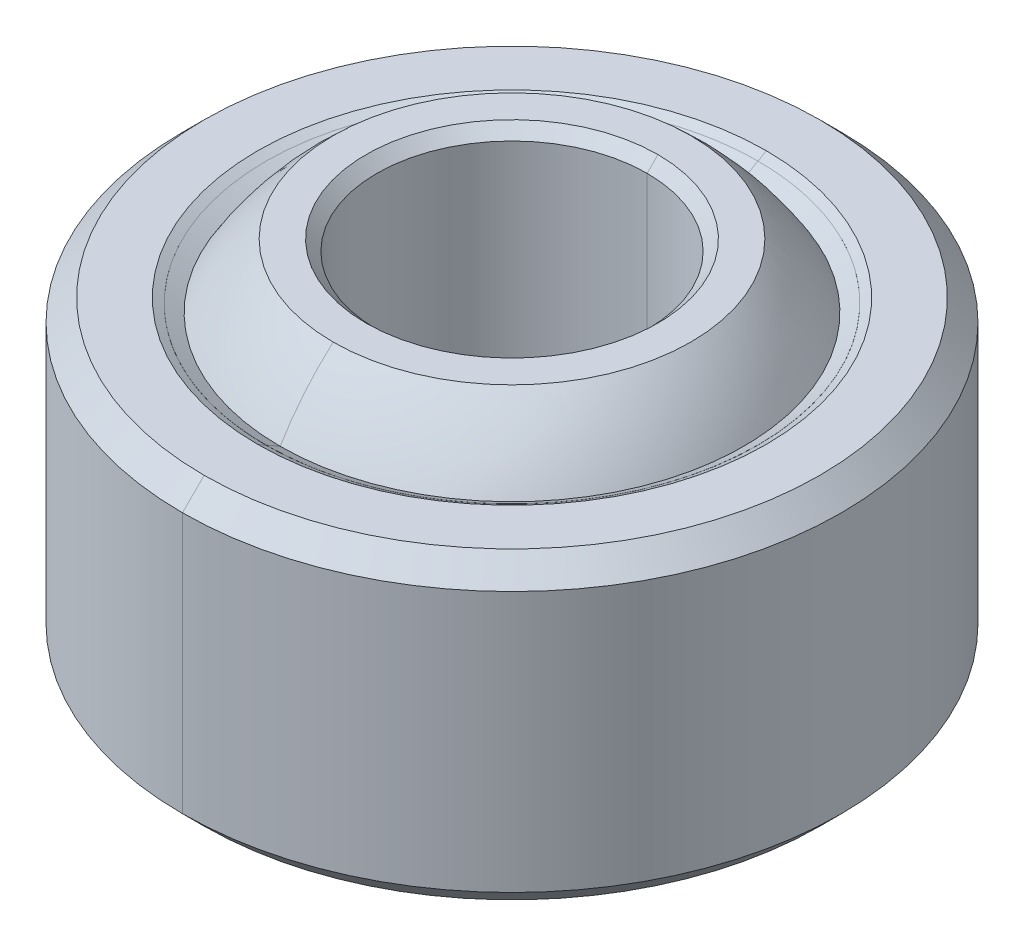
ISO-10303-21;
HEADER;
FILE_DESCRIPTION(('STEP AP214'),'2;1');
FILE_NAME('part.step','',(''),(''),'','','');
FILE_SCHEMA(('AUTOMOTIVE_DESIGN { 1 0 10303 214 1 1 1 1 }'));
ENDSEC;
DATA;
#1=APPLICATION_CONTEXT('core data for automotive mechanical design processes');
#2=APPLICATION_PROTOCOL_DEFINITION('international standard','automotive_design',2000,#1);
#3=PRODUCT_CONTEXT('',#1,'mechanical');
#4=PRODUCT('Part','Part','',(#3));
#5=PRODUCT_RELATED_PRODUCT_CATEGORY('part','',(#4));
#6=PRODUCT_DEFINITION_FORMATION('','',#4);
#7=PRODUCT_DEFINITION_CONTEXT('part definition',#1,'design');
#8=PRODUCT_DEFINITION('design','',#6,#7);
#9=PRODUCT_DEFINITION_SHAPE('','',#8);
#10=(LENGTH_UNIT() NAMED_UNIT(*) SI_UNIT(.MILLI.,.METRE.));
#11=(NAMED_UNIT(*) PLANE_ANGLE_UNIT() SI_UNIT($,.RADIAN.));
#12=(NAMED_UNIT(*) SI_UNIT($,.STERADIAN.) SOLID_ANGLE_UNIT());
#13=UNCERTAINTY_MEASURE_WITH_UNIT(LENGTH_MEASURE(1.E-05),#10,'distance_accuracy_value','');
#14=(GEOMETRIC_REPRESENTATION_CONTEXT(3) GLOBAL_UNCERTAINTY_ASSIGNED_CONTEXT((#13)) GLOBAL_UNIT_ASSIGNED_CONTEXT((#10,
#11,#12)) REPRESENTATION_CONTEXT('',''));
#15=CARTESIAN_POINT('',(0.,0.,0.));
#16=DIRECTION('',(0.,0.,1.));
#17=DIRECTION('',(1.,0.,0.));
#18=AXIS2_PLACEMENT_3D('',#15,#16,#17);
#19=CARTESIAN_POINT('',(0.,3.5687,-6.60254622031259));
#20=DIRECTION('',(0.,1.,0.));
#21=DIRECTION('',(1.,0.,0.));
#22=AXIS2_PLACEMENT_3D('',#19,#20,#21);
#23=PLANE('',#22);
#24=CARTESIAN_POINT('',(0.,3.5687,0.));
#25=DIRECTION('',(0.,-1.,0.));
#26=DIRECTION('',(0.,0.,-1.));
#27=AXIS2_PLACEMENT_3D('',#24,#25,#26);
#28=CIRCLE('',#27,7.23138);
#29=CARTESIAN_POINT('',(0.,3.5687,-7.23138));
#30=VERTEX_POINT('',#29);
#31=CARTESIAN_POINT('',(0.,3.5687,7.23138));
#32=VERTEX_POINT('',#31);
#33=EDGE_CURVE('P0_E43',#30,#32,#28,.T.);
#34=ORIENTED_EDGE('',*,*,#33,.F.);
#35=CARTESIAN_POINT('',(0.,3.5687,0.));
#36=DIRECTION('',(0.,-1.,0.));
#37=DIRECTION('',(0.,0.,-1.));
#38=AXIS2_PLACEMENT_3D('',#35,#36,#37);
#39=CIRCLE('',#38,7.23138);
#40=EDGE_CURVE('P0_E251',#32,#30,#39,.T.);
#41=ORIENTED_EDGE('',*,*,#40,.F.);
#42=EDGE_LOOP('',(#34,#41));
#43=FACE_BOUND('',#42,.T.);
#44=CARTESIAN_POINT('',(0.,3.5687,0.));
#45=DIRECTION('',(0.,-1.,0.));
#46=DIRECTION('',(0.,0.,-1.));
#47=AXIS2_PLACEMENT_3D('',#44,#45,#46);
#48=CIRCLE('',#47,5.97371244062518);
#49=CARTESIAN_POINT('',(0.,3.5687,-5.97371244062518));
#50=VERTEX_POINT('',#49);
#51=CARTESIAN_POINT('',(0.,3.5687,5.97371244062518));
#52=VERTEX_POINT('',#51);
#53=EDGE_CURVE('P0_E11',#50,#52,#48,.T.);
#54=ORIENTED_EDGE('',*,*,#53,.T.);
#55=CARTESIAN_POINT('',(0.,3.5687,0.));
#56=DIRECTION('',(0.,-1.,0.));
#57=DIRECTION('',(0.,0.,-1.));
#58=AXIS2_PLACEMENT_3D('',#55,#56,#57);
#59=CIRCLE('',#58,5.97371244062518);
#60=EDGE_CURVE('P0_E29',#52,#50,#59,.T.);
#61=ORIENTED_EDGE('',*,*,#60,.T.);
#62=EDGE_LOOP('',(#54,#61));
#63=FACE_BOUND('',#62,.T.);
#64=ADVANCED_FACE('P0_F16',(#43,#63),#23,.T.);
#65=CARTESIAN_POINT('',(0.,3.416554,0.));
#66=DIRECTION('',(0.,1.,0.));
#67=DIRECTION('',(0.,0.,-1.));
#68=AXIS2_PLACEMENT_3D('',#65,#66,#67);
#69=CONICAL_SURFACE('',#68,5.71018783845681,1.0471975511966);
#70=DIRECTION('',(0.,-0.5,0.866025403784439));
#71=VECTOR('',#70,1.);
#72=CARTESIAN_POINT('',(0.,3.416554,-5.71018783845681));
#73=LINE('',#72,#71);
#74=CARTESIAN_POINT('',(0.,3.45493198231586,-5.77666045371986));
#75=VERTEX_POINT('',#74);
#76=EDGE_CURVE('P0_E223',#50,#75,#73,.T.);
#77=ORIENTED_EDGE('',*,*,#76,.T.);
#78=CARTESIAN_POINT('',(0.,3.45493198231586,0.));
#79=DIRECTION('',(0.,1.,0.));
#80=DIRECTION('',(0.,0.,-1.));
#81=AXIS2_PLACEMENT_3D('',#78,#79,#80);
#82=CIRCLE('',#81,5.77666045371986);
#83=CARTESIAN_POINT('',(0.,3.45493198231587,5.77666045371987));
#84=VERTEX_POINT('',#83);
#85=EDGE_CURVE('P0_E283',#84,#75,#82,.T.);
#86=ORIENTED_EDGE('',*,*,#85,.F.);
#87=DIRECTION('',(0.,0.5,0.866025403784439));
#88=VECTOR('',#87,1.);
#89=CARTESIAN_POINT('',(0.,3.416554,5.71018783845681));
#90=LINE('',#89,#88);
#91=EDGE_CURVE('P0_E227',#84,#52,#90,.T.);
#92=ORIENTED_EDGE('',*,*,#91,.T.);
#93=ORIENTED_EDGE('',*,*,#53,.F.);
#94=EDGE_LOOP('',(#77,#86,#92,#93));
#95=FACE_BOUND('',#94,.T.);
#96=ADVANCED_FACE('P0_F308',(#95),#69,.F.);
#97=CARTESIAN_POINT('',(0.,3.416554,0.));
#98=DIRECTION('',(0.,1.,0.));
#99=DIRECTION('',(0.,0.,-1.));
#100=AXIS2_PLACEMENT_3D('',#97,#98,#99);
#101=CONICAL_SURFACE('',#100,5.71018783845681,1.0471975511966);
#102=ORIENTED_EDGE('',*,*,#76,.F.);
#103=ORIENTED_EDGE('',*,*,#60,.F.);
#104=ORIENTED_EDGE('',*,*,#91,.F.);
#105=CARTESIAN_POINT('',(0.,3.45493198231586,0.));
#106=DIRECTION('',(0.,1.,0.));
#107=DIRECTION('',(0.,0.,-1.));
#108=AXIS2_PLACEMENT_3D('',#105,#106,#107);
#109=CIRCLE('',#108,5.77666045371986);
#110=EDGE_CURVE('P0_E235',#75,#84,#109,.T.);
#111=ORIENTED_EDGE('',*,*,#110,.F.);
#112=EDGE_LOOP('',(#102,#103,#104,#111));
#113=FACE_BOUND('',#112,.T.);
#114=ADVANCED_FACE('P0_F392',(#113),#101,.F.);
#115=CARTESIAN_POINT('',(0.,3.3147,0.));
#116=DIRECTION('',(0.,-1.,0.));
#117=DIRECTION('',(0.,0.,-1.));
#118=AXIS2_PLACEMENT_3D('',#115,#116,#117);
#119=CONICAL_SURFACE('',#118,7.48538,0.785398163397449);
#120=DIRECTION('',(0.,-0.707106781186547,-0.707106781186548));
#121=VECTOR('',#120,1.);
#122=CARTESIAN_POINT('',(0.,3.3147,-7.48538));
#123=LINE('',#122,#121);
#124=CARTESIAN_POINT('',(0.,3.0607,-7.73938));
#125=VERTEX_POINT('',#124);
#126=EDGE_CURVE('P0_E250',#30,#125,#123,.T.);
#127=ORIENTED_EDGE('',*,*,#126,.T.);
#128=CARTESIAN_POINT('',(0.,3.0607,0.));
#129=DIRECTION('',(0.,-1.,0.));
#130=DIRECTION('',(0.,0.,-1.));
#131=AXIS2_PLACEMENT_3D('',#128,#129,#130);
#132=CIRCLE('',#131,7.73938);
#133=CARTESIAN_POINT('',(0.,3.0607,7.73938));
#134=VERTEX_POINT('',#133);
#135=EDGE_CURVE('P0_E245',#134,#125,#132,.T.);
#136=ORIENTED_EDGE('',*,*,#135,.F.);
#137=DIRECTION('',(0.,0.707106781186547,-0.707106781186548));
#138=VECTOR('',#137,1.);
#139=CARTESIAN_POINT('',(0.,3.3147,7.48538));
#140=LINE('',#139,#138);
#141=EDGE_CURVE('P0_E246',#134,#32,#140,.T.);
#142=ORIENTED_EDGE('',*,*,#141,.T.);
#143=ORIENTED_EDGE('',*,*,#40,.T.);
#144=EDGE_LOOP('',(#127,#136,#142,#143));
#145=FACE_BOUND('',#144,.T.);
#146=ADVANCED_FACE('P0_F359',(#145),#119,.T.);
#147=CARTESIAN_POINT('',(0.,3.3147,0.));
#148=DIRECTION('',(0.,-1.,0.));
#149=DIRECTION('',(0.,0.,-1.));
#150=AXIS2_PLACEMENT_3D('',#147,#148,#149);
#151=CONICAL_SURFACE('',#150,7.48538,0.785398163397449);
#152=ORIENTED_EDGE('',*,*,#126,.F.);
#153=ORIENTED_EDGE('',*,*,#33,.T.);
#154=ORIENTED_EDGE('',*,*,#141,.F.);
#155=CARTESIAN_POINT('',(0.,3.0607,0.));
#156=DIRECTION('',(0.,-1.,0.));
#157=DIRECTION('',(0.,0.,-1.));
#158=AXIS2_PLACEMENT_3D('',#155,#156,#157);
#159=CIRCLE('',#158,7.73938);
#160=EDGE_CURVE('P0_E105',#125,#134,#159,.T.);
#161=ORIENTED_EDGE('',*,*,#160,.F.);
#162=EDGE_LOOP('',(#152,#153,#154,#161));
#163=FACE_BOUND('',#162,.T.);
#164=ADVANCED_FACE('P0_F409',(#163),#151,.T.);
#165=CARTESIAN_POINT('',(0.,0.,0.));
#166=DIRECTION('',(0.,0.,1.));
#167=DIRECTION('',(1.,0.,0.));
#168=AXIS2_PLACEMENT_3D('',#165,#166,#167);
#169=SPHERICAL_SURFACE('',#168,6.731);
#170=CARTESIAN_POINT('',(0.,0.,0.));
#171=DIRECTION('',(1.,0.,0.));
#172=DIRECTION('',(0.,0.,1.));
#173=AXIS2_PLACEMENT_3D('',#170,#171,#172);
#174=CIRCLE('',#173,6.731);
#175=CARTESIAN_POINT('',(0.,3.45642946,-5.77576457172937));
#176=VERTEX_POINT('',#175);
#177=EDGE_CURVE('P0_E254',#75,#176,#174,.T.);
#178=ORIENTED_EDGE('',*,*,#177,.T.);
#179=CARTESIAN_POINT('',(0.,3.45642946,0.));
#180=DIRECTION('',(0.,-1.,0.));
#181=DIRECTION('',(0.,0.,-1.));
#182=AXIS2_PLACEMENT_3D('',#179,#180,#181);
#183=CIRCLE('',#182,5.77576457172937);
#184=CARTESIAN_POINT('',(0.,3.45642946,5.77576457172937));
#185=VERTEX_POINT('',#184);
#186=EDGE_CURVE('P0_E275',#176,#185,#183,.T.);
#187=ORIENTED_EDGE('',*,*,#186,.T.);
#188=CARTESIAN_POINT('',(0.,0.,0.));
#189=DIRECTION('',(1.,0.,0.));
#190=DIRECTION('',(0.,0.,1.));
#191=AXIS2_PLACEMENT_3D('',#188,#189,#190);
#192=CIRCLE('',#191,6.731);
#193=EDGE_CURVE('P0_E279',#185,#84,#192,.T.);
#194=ORIENTED_EDGE('',*,*,#193,.T.);
#195=ORIENTED_EDGE('',*,*,#85,.T.);
#196=EDGE_LOOP('',(#178,#187,#194,#195));
#197=FACE_BOUND('',#196,.T.);
#198=ADVANCED_FACE('P0_F300',(#197),#169,.T.);
#199=CARTESIAN_POINT('',(0.,0.,0.));
#200=DIRECTION('',(0.,0.,1.));
#201=DIRECTION('',(1.,0.,0.));
#202=AXIS2_PLACEMENT_3D('',#199,#200,#201);
#203=SPHERICAL_SURFACE('',#202,6.731);
#204=ORIENTED_EDGE('',*,*,#177,.F.);
#205=ORIENTED_EDGE('',*,*,#110,.T.);
#206=ORIENTED_EDGE('',*,*,#193,.F.);
#207=CARTESIAN_POINT('',(0.,3.45642946,0.));
#208=DIRECTION('',(0.,-1.,0.));
#209=DIRECTION('',(0.,0.,-1.));
#210=AXIS2_PLACEMENT_3D('',#207,#208,#209);
#211=CIRCLE('',#210,5.77576457172937);
#212=EDGE_CURVE('P0_E86',#185,#176,#211,.T.);
#213=ORIENTED_EDGE('',*,*,#212,.T.);
#214=EDGE_LOOP('',(#204,#205,#206,#213));
#215=FACE_BOUND('',#214,.T.);
#216=ADVANCED_FACE('P0_F310',(#215),#203,.T.);
#217=CARTESIAN_POINT('',(0.,0.,0.));
#218=DIRECTION('',(0.,-1.,0.));
#219=DIRECTION('',(0.,0.,-1.));
#220=AXIS2_PLACEMENT_3D('',#217,#218,#219);
#221=CYLINDRICAL_SURFACE('',#220,7.73938);
#222=DIRECTION('',(0.,-1.,0.));
#223=VECTOR('',#222,1.);
#224=CARTESIAN_POINT('',(0.,0.,-7.73938));
#225=LINE('',#224,#223);
#226=CARTESIAN_POINT('',(0.,-3.0607,-7.73938));
#227=VERTEX_POINT('',#226);
#228=EDGE_CURVE('P0_E236',#125,#227,#225,.T.);
#229=ORIENTED_EDGE('',*,*,#228,.T.);
#230=CARTESIAN_POINT('',(0.,-3.0607,0.));
#231=DIRECTION('',(0.,-1.,0.));
#232=DIRECTION('',(0.,0.,-1.));
#233=AXIS2_PLACEMENT_3D('',#230,#231,#232);
#234=CIRCLE('',#233,7.73938);
#235=CARTESIAN_POINT('',(0.,-3.0607,7.73938));
#236=VERTEX_POINT('',#235);
#237=EDGE_CURVE('P0_E222',#236,#227,#234,.T.);
#238=ORIENTED_EDGE('',*,*,#237,.F.);
#239=DIRECTION('',(0.,1.,0.));
#240=VECTOR('',#239,1.);
#241=CARTESIAN_POINT('',(0.,0.,7.73938));
#242=LINE('',#241,#240);
#243=EDGE_CURVE('P0_E241',#236,#134,#242,.T.);
#244=ORIENTED_EDGE('',*,*,#243,.T.);
#245=ORIENTED_EDGE('',*,*,#135,.T.);
#246=EDGE_LOOP('',(#229,#238,#244,#245));
#247=FACE_BOUND('',#246,.T.);
#248=ADVANCED_FACE('P0_F353',(#247),#221,.T.);
#249=CARTESIAN_POINT('',(0.,0.,0.));
#250=DIRECTION('',(0.,-1.,0.));
#251=DIRECTION('',(0.,0.,-1.));
#252=AXIS2_PLACEMENT_3D('',#249,#250,#251);
#253=CYLINDRICAL_SURFACE('',#252,7.73938);
#254=ORIENTED_EDGE('',*,*,#228,.F.);
#255=ORIENTED_EDGE('',*,*,#160,.T.);
#256=ORIENTED_EDGE('',*,*,#243,.F.);
#257=CARTESIAN_POINT('',(0.,-3.0607,0.));
#258=DIRECTION('',(0.,-1.,0.));
#259=DIRECTION('',(0.,0.,-1.));
#260=AXIS2_PLACEMENT_3D('',#257,#258,#259);
#261=CIRCLE('',#260,7.73938);
#262=EDGE_CURVE('P0_E219',#227,#236,#261,.T.);
#263=ORIENTED_EDGE('',*,*,#262,.F.);
#264=EDGE_LOOP('',(#254,#255,#256,#263));
#265=FACE_BOUND('',#264,.T.);
#266=ADVANCED_FACE('P0_F361',(#265),#253,.T.);
#267=CARTESIAN_POINT('',(0.,3.361182,0.));
#268=DIRECTION('',(0.,1.,0.));
#269=DIRECTION('',(0.,0.,-1.));
#270=AXIS2_PLACEMENT_3D('',#267,#268,#269);
#271=CONICAL_SURFACE('',#270,5.61079113171748,1.0471975511966);
#272=DIRECTION('',(0.,-0.5,0.866025403784439));
#273=VECTOR('',#272,1.);
#274=CARTESIAN_POINT('',(0.,3.361182,-5.61079113171748));
#275=LINE('',#274,#273);
#276=CARTESIAN_POINT('',(0.,3.26593453999999,-5.44581769170559));
#277=VERTEX_POINT('',#276);
#278=EDGE_CURVE('P0_E319',#176,#277,#275,.T.);
#279=ORIENTED_EDGE('',*,*,#278,.T.);
#280=CARTESIAN_POINT('',(0.,3.26593453999999,0.));
#281=DIRECTION('',(0.,-1.,0.));
#282=DIRECTION('',(0.,0.,-1.));
#283=AXIS2_PLACEMENT_3D('',#280,#281,#282);
#284=CIRCLE('',#283,5.44581769170559);
#285=CARTESIAN_POINT('',(0.,3.26593453999999,5.44581769170559));
#286=VERTEX_POINT('',#285);
#287=EDGE_CURVE('P0_E320',#277,#286,#284,.T.);
#288=ORIENTED_EDGE('',*,*,#287,.T.);
#289=DIRECTION('',(0.,0.5,0.866025403784439));
#290=VECTOR('',#289,1.);
#291=CARTESIAN_POINT('',(0.,3.361182,5.61079113171748));
#292=LINE('',#291,#290);
#293=EDGE_CURVE('P0_E274',#286,#185,#292,.T.);
#294=ORIENTED_EDGE('',*,*,#293,.T.);
#295=ORIENTED_EDGE('',*,*,#186,.F.);
#296=EDGE_LOOP('',(#279,#288,#294,#295));
#297=FACE_BOUND('',#296,.T.);
#298=ADVANCED_FACE('P0_F376',(#297),#271,.F.);
#299=CARTESIAN_POINT('',(0.,3.361182,0.));
#300=DIRECTION('',(0.,1.,0.));
#301=DIRECTION('',(0.,0.,-1.));
#302=AXIS2_PLACEMENT_3D('',#299,#300,#301);
#303=CONICAL_SURFACE('',#302,5.61079113171748,1.0471975511966);
#304=ORIENTED_EDGE('',*,*,#278,.F.);
#305=ORIENTED_EDGE('',*,*,#212,.F.);
#306=ORIENTED_EDGE('',*,*,#293,.F.);
#307=CARTESIAN_POINT('',(0.,3.26593453999999,0.));
#308=DIRECTION('',(0.,-1.,0.));
#309=DIRECTION('',(0.,0.,-1.));
#310=AXIS2_PLACEMENT_3D('',#307,#308,#309);
#311=CIRCLE('',#310,5.44581769170559);
#312=EDGE_CURVE('P0_E270',#286,#277,#311,.T.);
#313=ORIENTED_EDGE('',*,*,#312,.T.);
#314=EDGE_LOOP('',(#304,#305,#306,#313));
#315=FACE_BOUND('',#314,.T.);
#316=ADVANCED_FACE('P0_F370',(#315),#303,.F.);
#317=CARTESIAN_POINT('',(0.,-3.3147,0.));
#318=DIRECTION('',(0.,1.,0.));
#319=DIRECTION('',(0.,0.,-1.));
#320=AXIS2_PLACEMENT_3D('',#317,#318,#319);
#321=CONICAL_SURFACE('',#320,7.48538,0.785398163397449);
#322=DIRECTION('',(0.,-0.707106781186547,0.707106781186548));
#323=VECTOR('',#322,1.);
#324=CARTESIAN_POINT('',(0.,-3.3147,-7.48538));
#325=LINE('',#324,#323);
#326=CARTESIAN_POINT('',(0.,-3.5687,-7.23138));
#327=VERTEX_POINT('',#326);
#328=EDGE_CURVE('P0_E267',#227,#327,#325,.T.);
#329=ORIENTED_EDGE('',*,*,#328,.T.);
#330=CARTESIAN_POINT('',(0.,-3.5687,0.));
#331=DIRECTION('',(0.,-1.,0.));
#332=DIRECTION('',(0.,0.,-1.));
#333=AXIS2_PLACEMENT_3D('',#330,#331,#332);
#334=CIRCLE('',#333,7.23138);
#335=CARTESIAN_POINT('',(0.,-3.5687,7.23138));
#336=VERTEX_POINT('',#335);
#337=EDGE_CURVE('P0_E22',#336,#327,#334,.T.);
#338=ORIENTED_EDGE('',*,*,#337,.F.);
#339=DIRECTION('',(0.,0.707106781186547,0.707106781186548));
#340=VECTOR('',#339,1.);
#341=CARTESIAN_POINT('',(0.,-3.3147,7.48538));
#342=LINE('',#341,#340);
#343=EDGE_CURVE('P0_E240',#336,#236,#342,.T.);
#344=ORIENTED_EDGE('',*,*,#343,.T.);
#345=ORIENTED_EDGE('',*,*,#237,.T.);
#346=EDGE_LOOP('',(#329,#338,#344,#345));
#347=FACE_BOUND('',#346,.T.);
#348=ADVANCED_FACE('P0_F363',(#347),#321,.T.);
#349=CARTESIAN_POINT('',(0.,-3.3147,0.));
#350=DIRECTION('',(0.,1.,0.));
#351=DIRECTION('',(0.,0.,-1.));
#352=AXIS2_PLACEMENT_3D('',#349,#350,#351);
#353=CONICAL_SURFACE('',#352,7.48538,0.785398163397449);
#354=ORIENTED_EDGE('',*,*,#328,.F.);
#355=ORIENTED_EDGE('',*,*,#262,.T.);
#356=ORIENTED_EDGE('',*,*,#343,.F.);
#357=CARTESIAN_POINT('',(0.,-3.5687,0.));
#358=DIRECTION('',(0.,-1.,0.));
#359=DIRECTION('',(0.,0.,-1.));
#360=AXIS2_PLACEMENT_3D('',#357,#358,#359);
#361=CIRCLE('',#360,7.23138);
#362=EDGE_CURVE('P0_E258',#327,#336,#361,.T.);
#363=ORIENTED_EDGE('',*,*,#362,.F.);
#364=EDGE_LOOP('',(#354,#355,#356,#363));
#365=FACE_BOUND('',#364,.T.);
#366=ADVANCED_FACE('P0_F386',(#365),#353,.T.);
#367=CARTESIAN_POINT('',(0.,-6.35001015973679,0.));
#368=CARTESIAN_POINT('',(0.,-6.35001015973679,0.));
#369=CARTESIAN_POINT('',(0.,-6.35001015973679,0.));
#370=CARTESIAN_POINT('',(0.,-6.35001015973679,0.));
#371=CARTESIAN_POINT('',(0.,-6.35001015973679,0.));
#372=CARTESIAN_POINT('',(0.,-6.35004354065329,-3.66620577158731));
#373=CARTESIAN_POINT('',(3.6662057715873,-6.35004354065329,-3.66620577158731));
#374=CARTESIAN_POINT('',(3.66620577158731,-6.35004354065329,0.));
#375=CARTESIAN_POINT('',(3.6662057715873,-6.35004354065329,3.6662057715873));
#376=CARTESIAN_POINT('',(0.,-6.35004354065329,3.66620577158731));
#377=CARTESIAN_POINT('',(0.,-3.17502177032665,-5.49931829368906));
#378=CARTESIAN_POINT('',(5.49931829368906,-3.17502177032665,-5.49931829368906));
#379=CARTESIAN_POINT('',(5.49931829368906,-3.17502177032665,0.));
#380=CARTESIAN_POINT('',(5.49931829368906,-3.17502177032665,5.49931829368906));
#381=CARTESIAN_POINT('',(0.,-3.17502177032665,5.49931829368906));
#382=CARTESIAN_POINT('',(0.,0.,-7.33243081579083));
#383=CARTESIAN_POINT('',(7.33243081579082,0.,-7.33243081579082));
#384=CARTESIAN_POINT('',(7.33243081579083,0.,0.));
#385=CARTESIAN_POINT('',(7.33243081579082,0.,7.33243081579082));
#386=CARTESIAN_POINT('',(0.,0.,7.33243081579083));
#387=CARTESIAN_POINT('',(0.,3.17502177032663,-5.49931829368906));
#388=CARTESIAN_POINT('',(5.49931829368906,3.17502177032663,-5.49931829368906));
#389=CARTESIAN_POINT('',(5.49931829368906,3.17502177032663,0.));
#390=CARTESIAN_POINT('',(5.49931829368906,3.17502177032663,5.49931829368906));
#391=CARTESIAN_POINT('',(0.,3.17502177032663,5.49931829368906));
#392=CARTESIAN_POINT('',(0.,6.35004354065328,-3.66620577158731));
#393=CARTESIAN_POINT('',(3.66620577158731,6.35004354065327,-3.66620577158731));
#394=CARTESIAN_POINT('',(3.66620577158731,6.35004354065328,0.));
#395=CARTESIAN_POINT('',(3.66620577158731,6.35004354065327,3.66620577158731));
#396=CARTESIAN_POINT('',(0.,6.35004354065328,3.66620577158731));
#397=CARTESIAN_POINT('',(0.,6.35001015973677,0.));
#398=CARTESIAN_POINT('',(0.,6.35001015973677,0.));
#399=CARTESIAN_POINT('',(0.,6.35001015973677,0.));
#400=CARTESIAN_POINT('',(0.,6.35001015973677,0.));
#401=CARTESIAN_POINT('',(0.,6.35001015973677,0.));
#402=(BOUNDED_SURFACE() B_SPLINE_SURFACE(2,2,((#367,#368,#369,#370,#371),(#372,#373,#374,#375,
#376),(#377,#378,#379,#380,#381),(#382,#383,#384,#385,#386),(#387,#388,#389,#390,#391),(#392,
#393,#394,#395,#396),(#397,#398,#399,#400,#401)),.UNSPECIFIED.,.F.,.F.,
.F.) B_SPLINE_SURFACE_WITH_KNOTS((3,2,2,3),(3,2,3),(1.57078722176409,2.61799084298123,
3.66519446419836,4.7123980854155),(3.14159265358979,4.71238898038469,6.28318530717959),
.UNSPECIFIED.) GEOMETRIC_REPRESENTATION_ITEM() RATIONAL_B_SPLINE_SURFACE(((1.,0.707106781186548,
1.,0.707106781186548,1.),(0.866023886275315,0.612371362654803,0.866023886275315,
0.612371362654803,0.866023886275315),(1.,0.707106781186548,1.,0.707106781186548,1.),
(0.866023886275315,0.612371362654803,0.866023886275315,0.612371362654803,0.866023886275315),(1.,
0.707106781186548,1.,0.707106781186548,1.),(0.866023886275318,0.612371362654805,
0.866023886275318,0.612371362654805,0.866023886275318),(1.,0.707106781186548,1.,
0.707106781186548,1.))) REPRESENTATION_ITEM('') SURFACE());
#403=CARTESIAN_POINT('',(0.,0.,-5.78170381340115E-05));
#404=DIRECTION('',(1.,0.,0.));
#405=DIRECTION('',(0.,0.,-1.));
#406=AXIS2_PLACEMENT_3D('',#403,#404,#405);
#407=CIRCLE('',#406,6.35001015999999);
#408=CARTESIAN_POINT('',(0.,-3.26593454,-5.4458176917056));
#409=VERTEX_POINT('',#408);
#410=EDGE_CURVE('P0_E286',#409,#277,#407,.T.);
#411=CARTESIAN_POINT('',(0.,-3.26593454,0.));
#412=DIRECTION('',(0.,-1.,0.));
#413=DIRECTION('',(0.,0.,-1.));
#414=AXIS2_PLACEMENT_3D('',#411,#412,#413);
#415=CIRCLE('',#414,5.4458176917056);
#416=CARTESIAN_POINT('',(0.,-3.26593454,5.4458176917056));
#417=VERTEX_POINT('',#416);
#418=EDGE_CURVE('P0_E202',#409,#417,#415,.T.);
#419=CARTESIAN_POINT('',(0.,0.,5.78170381340115E-05));
#420=DIRECTION('',(1.,0.,0.));
#421=DIRECTION('',(0.,0.,1.));
#422=AXIS2_PLACEMENT_3D('',#419,#420,#421);
#423=CIRCLE('',#422,6.35001015999999);
#424=EDGE_CURVE('P0_E257',#286,#417,#423,.T.);
#425=ORIENTED_EDGE('',*,*,#410,.F.);
#426=ORIENTED_EDGE('',*,*,#418,.T.);
#427=ORIENTED_EDGE('',*,*,#424,.F.);
#428=ORIENTED_EDGE('',*,*,#287,.F.);
#429=EDGE_LOOP('',(#425,#426,#427,#428));
#430=FACE_BOUND('',#429,.T.);
#431=ADVANCED_FACE('P0_F374',(#430),#402,.F.);
#432=CARTESIAN_POINT('',(0.,-6.35001015973679,0.));
#433=CARTESIAN_POINT('',(0.,-6.35001015973679,0.));
#434=CARTESIAN_POINT('',(0.,-6.35001015973679,0.));
#435=CARTESIAN_POINT('',(0.,-6.35001015973679,0.));
#436=CARTESIAN_POINT('',(0.,-6.35001015973679,0.));
#437=CARTESIAN_POINT('',(0.,-6.35004354065329,3.66620577158731));
#438=CARTESIAN_POINT('',(-3.66620577158731,-6.35004354065329,3.6662057715873));
#439=CARTESIAN_POINT('',(-3.66620577158731,-6.35004354065329,0.));
#440=CARTESIAN_POINT('',(-3.66620577158731,-6.35004354065329,-3.66620577158731));
#441=CARTESIAN_POINT('',(0.,-6.35004354065329,-3.66620577158731));
#442=CARTESIAN_POINT('',(0.,-3.17502177032665,5.49931829368906));
#443=CARTESIAN_POINT('',(-5.49931829368906,-3.17502177032665,5.49931829368906));
#444=CARTESIAN_POINT('',(-5.49931829368906,-3.17502177032665,0.));
#445=CARTESIAN_POINT('',(-5.49931829368906,-3.17502177032665,-5.49931829368906));
#446=CARTESIAN_POINT('',(0.,-3.17502177032665,-5.49931829368906));
#447=CARTESIAN_POINT('',(0.,0.,7.33243081579083));
#448=CARTESIAN_POINT('',(-7.33243081579082,0.,7.33243081579082));
#449=CARTESIAN_POINT('',(-7.33243081579083,0.,0.));
#450=CARTESIAN_POINT('',(-7.33243081579082,0.,-7.33243081579082));
#451=CARTESIAN_POINT('',(0.,0.,-7.33243081579083));
#452=CARTESIAN_POINT('',(0.,3.17502177032663,5.49931829368906));
#453=CARTESIAN_POINT('',(-5.49931829368906,3.17502177032663,5.49931829368906));
#454=CARTESIAN_POINT('',(-5.49931829368906,3.17502177032663,0.));
#455=CARTESIAN_POINT('',(-5.49931829368906,3.17502177032663,-5.49931829368906));
#456=CARTESIAN_POINT('',(0.,3.17502177032663,-5.49931829368906));
#457=CARTESIAN_POINT('',(0.,6.35004354065328,3.66620577158731));
#458=CARTESIAN_POINT('',(-3.66620577158731,6.35004354065327,3.66620577158731));
#459=CARTESIAN_POINT('',(-3.66620577158731,6.35004354065328,0.));
#460=CARTESIAN_POINT('',(-3.66620577158731,6.35004354065327,-3.66620577158731));
#461=CARTESIAN_POINT('',(0.,6.35004354065328,-3.66620577158731));
#462=CARTESIAN_POINT('',(0.,6.35001015973677,0.));
#463=CARTESIAN_POINT('',(0.,6.35001015973677,0.));
#464=CARTESIAN_POINT('',(0.,6.35001015973677,0.));
#465=CARTESIAN_POINT('',(0.,6.35001015973677,0.));
#466=CARTESIAN_POINT('',(0.,6.35001015973677,0.));
#467=(BOUNDED_SURFACE() B_SPLINE_SURFACE(2,2,((#432,#433,#434,#435,#436),(#437,#438,#439,#440,
#441),(#442,#443,#444,#445,#446),(#447,#448,#449,#450,#451),(#452,#453,#454,#455,#456),(#457,
#458,#459,#460,#461),(#462,#463,#464,#465,#466)),.UNSPECIFIED.,.F.,.F.,
.F.) B_SPLINE_SURFACE_WITH_KNOTS((3,2,2,3),(3,2,3),(1.57078722176409,2.61799084298123,
3.66519446419836,4.7123980854155),(0.,1.5707963267949,3.14159265358979),
.UNSPECIFIED.) GEOMETRIC_REPRESENTATION_ITEM() RATIONAL_B_SPLINE_SURFACE(((1.,0.707106781186548,
1.,0.707106781186548,1.),(0.866023886275315,0.612371362654803,0.866023886275315,
0.612371362654803,0.866023886275315),(1.,0.707106781186548,1.,0.707106781186548,1.),
(0.866023886275315,0.612371362654803,0.866023886275315,0.612371362654803,0.866023886275315),(1.,
0.707106781186548,1.,0.707106781186548,1.),(0.866023886275318,0.612371362654805,
0.866023886275318,0.612371362654805,0.866023886275318),(1.,0.707106781186548,1.,
0.707106781186548,1.))) REPRESENTATION_ITEM('') SURFACE());
#468=CARTESIAN_POINT('',(0.,-3.26593454,0.));
#469=DIRECTION('',(0.,-1.,0.));
#470=DIRECTION('',(0.,0.,-1.));
#471=AXIS2_PLACEMENT_3D('',#468,#469,#470);
#472=CIRCLE('',#471,5.4458176917056);
#473=EDGE_CURVE('P0_E133',#417,#409,#472,.T.);
#474=ORIENTED_EDGE('',*,*,#410,.T.);
#475=ORIENTED_EDGE('',*,*,#312,.F.);
#476=ORIENTED_EDGE('',*,*,#424,.T.);
#477=ORIENTED_EDGE('',*,*,#473,.T.);
#478=EDGE_LOOP('',(#474,#475,#476,#477));
#479=FACE_BOUND('',#478,.T.);
#480=ADVANCED_FACE('P0_F18',(#479),#467,.F.);
#481=CARTESIAN_POINT('',(0.,-3.5687,-6.60254622031259));
#482=DIRECTION('',(0.,-1.,0.));
#483=DIRECTION('',(0.,0.,-1.));
#484=AXIS2_PLACEMENT_3D('',#481,#482,#483);
#485=PLANE('',#484);
#486=CARTESIAN_POINT('',(0.,-3.5687,0.));
#487=DIRECTION('',(0.,-1.,0.));
#488=DIRECTION('',(0.,0.,-1.));
#489=AXIS2_PLACEMENT_3D('',#486,#487,#488);
#490=CIRCLE('',#489,5.97371244062518);
#491=CARTESIAN_POINT('',(0.,-3.5687,-5.97371244062518));
#492=VERTEX_POINT('',#491);
#493=CARTESIAN_POINT('',(0.,-3.5687,5.97371244062518));
#494=VERTEX_POINT('',#493);
#495=EDGE_CURVE('P0_E232',#492,#494,#490,.T.);
#496=ORIENTED_EDGE('',*,*,#495,.F.);
#497=CARTESIAN_POINT('',(0.,-3.5687,0.));
#498=DIRECTION('',(0.,-1.,0.));
#499=DIRECTION('',(0.,0.,-1.));
#500=AXIS2_PLACEMENT_3D('',#497,#498,#499);
#501=CIRCLE('',#500,5.97371244062518);
#502=EDGE_CURVE('P0_E147',#494,#492,#501,.T.);
#503=ORIENTED_EDGE('',*,*,#502,.F.);
#504=EDGE_LOOP('',(#496,#503));
#505=FACE_BOUND('',#504,.T.);
#506=ORIENTED_EDGE('',*,*,#362,.T.);
#507=ORIENTED_EDGE('',*,*,#337,.T.);
#508=EDGE_LOOP('',(#506,#507));
#509=FACE_BOUND('',#508,.T.);
#510=ADVANCED_FACE('P0_F378',(#505,#509),#485,.T.);
#511=CARTESIAN_POINT('',(0.,-3.416554,0.));
#512=DIRECTION('',(0.,-1.,0.));
#513=DIRECTION('',(0.,0.,-1.));
#514=AXIS2_PLACEMENT_3D('',#511,#512,#513);
#515=CONICAL_SURFACE('',#514,5.71018783845681,1.0471975511966);
#516=DIRECTION('',(0.,-0.5,-0.866025403784439));
#517=VECTOR('',#516,1.);
#518=CARTESIAN_POINT('',(0.,-3.416554,-5.71018783845681));
#519=LINE('',#518,#517);
#520=CARTESIAN_POINT('',(0.,-3.45493198231587,-5.77666045371986));
#521=VERTEX_POINT('',#520);
#522=EDGE_CURVE('P0_E228',#521,#492,#519,.T.);
#523=ORIENTED_EDGE('',*,*,#522,.T.);
#524=ORIENTED_EDGE('',*,*,#495,.T.);
#525=DIRECTION('',(0.,0.5,-0.866025403784439));
#526=VECTOR('',#525,1.);
#527=CARTESIAN_POINT('',(0.,-3.416554,5.71018783845681));
#528=LINE('',#527,#526);
#529=CARTESIAN_POINT('',(0.,-3.45493198231586,5.77666045371986));
#530=VERTEX_POINT('',#529);
#531=EDGE_CURVE('P0_E204',#494,#530,#528,.T.);
#532=ORIENTED_EDGE('',*,*,#531,.T.);
#533=CARTESIAN_POINT('',(0.,-3.45493198231587,0.));
#534=DIRECTION('',(0.,-1.,0.));
#535=DIRECTION('',(0.,0.,-1.));
#536=AXIS2_PLACEMENT_3D('',#533,#534,#535);
#537=CIRCLE('',#536,5.77666045371986);
#538=EDGE_CURVE('P0_E209',#521,#530,#537,.T.);
#539=ORIENTED_EDGE('',*,*,#538,.F.);
#540=EDGE_LOOP('',(#523,#524,#532,#539));
#541=FACE_BOUND('',#540,.T.);
#542=ADVANCED_FACE('P0_F384',(#541),#515,.F.);
#543=CARTESIAN_POINT('',(0.,-3.361182,0.));
#544=DIRECTION('',(0.,-1.,0.));
#545=DIRECTION('',(0.,0.,-1.));
#546=AXIS2_PLACEMENT_3D('',#543,#544,#545);
#547=CONICAL_SURFACE('',#546,5.61079113171748,1.0471975511966);
#548=DIRECTION('',(0.,-0.5,-0.866025403784439));
#549=VECTOR('',#548,1.);
#550=CARTESIAN_POINT('',(0.,-3.361182,-5.61079113171748));
#551=LINE('',#550,#549);
#552=CARTESIAN_POINT('',(0.,-3.45642946,-5.77576457172937));
#553=VERTEX_POINT('',#552);
#554=EDGE_CURVE('P0_E180',#409,#553,#551,.T.);
#555=ORIENTED_EDGE('',*,*,#554,.T.);
#556=CARTESIAN_POINT('',(0.,-3.45642946,0.));
#557=DIRECTION('',(0.,-1.,0.));
#558=DIRECTION('',(0.,0.,-1.));
#559=AXIS2_PLACEMENT_3D('',#556,#557,#558);
#560=CIRCLE('',#559,5.77576457172937);
#561=CARTESIAN_POINT('',(0.,-3.45642946,5.77576457172937));
#562=VERTEX_POINT('',#561);
#563=EDGE_CURVE('P0_E192',#553,#562,#560,.T.);
#564=ORIENTED_EDGE('',*,*,#563,.T.);
#565=DIRECTION('',(0.,0.5,-0.866025403784439));
#566=VECTOR('',#565,1.);
#567=CARTESIAN_POINT('',(0.,-3.361182,5.61079113171748));
#568=LINE('',#567,#566);
#569=EDGE_CURVE('P0_E182',#562,#417,#568,.T.);
#570=ORIENTED_EDGE('',*,*,#569,.T.);
#571=ORIENTED_EDGE('',*,*,#418,.F.);
#572=EDGE_LOOP('',(#555,#564,#570,#571));
#573=FACE_BOUND('',#572,.T.);
#574=ADVANCED_FACE('P0_F200',(#573),#547,.F.);
#575=CARTESIAN_POINT('',(0.,-3.361182,0.));
#576=DIRECTION('',(0.,-1.,0.));
#577=DIRECTION('',(0.,0.,-1.));
#578=AXIS2_PLACEMENT_3D('',#575,#576,#577);
#579=CONICAL_SURFACE('',#578,5.61079113171748,1.0471975511966);
#580=ORIENTED_EDGE('',*,*,#554,.F.);
#581=ORIENTED_EDGE('',*,*,#473,.F.);
#582=ORIENTED_EDGE('',*,*,#569,.F.);
#583=CARTESIAN_POINT('',(0.,-3.45642946,0.));
#584=DIRECTION('',(0.,-1.,0.));
#585=DIRECTION('',(0.,0.,-1.));
#586=AXIS2_PLACEMENT_3D('',#583,#584,#585);
#587=CIRCLE('',#586,5.77576457172937);
#588=EDGE_CURVE('P0_E176',#562,#553,#587,.T.);
#589=ORIENTED_EDGE('',*,*,#588,.T.);
#590=EDGE_LOOP('',(#580,#581,#582,#589));
#591=FACE_BOUND('',#590,.T.);
#592=ADVANCED_FACE('P0_F178',(#591),#579,.F.);
#593=CARTESIAN_POINT('',(0.,-3.416554,0.));
#594=DIRECTION('',(0.,-1.,0.));
#595=DIRECTION('',(0.,0.,-1.));
#596=AXIS2_PLACEMENT_3D('',#593,#594,#595);
#597=CONICAL_SURFACE('',#596,5.71018783845681,1.0471975511966);
#598=ORIENTED_EDGE('',*,*,#522,.F.);
#599=CARTESIAN_POINT('',(0.,-3.45493198231587,0.));
#600=DIRECTION('',(0.,-1.,0.));
#601=DIRECTION('',(0.,0.,-1.));
#602=AXIS2_PLACEMENT_3D('',#599,#600,#601);
#603=CIRCLE('',#602,5.77666045371986);
#604=EDGE_CURVE('P0_E160',#530,#521,#603,.T.);
#605=ORIENTED_EDGE('',*,*,#604,.F.);
#606=ORIENTED_EDGE('',*,*,#531,.F.);
#607=ORIENTED_EDGE('',*,*,#502,.T.);
#608=EDGE_LOOP('',(#598,#605,#606,#607));
#609=FACE_BOUND('',#608,.T.);
#610=ADVANCED_FACE('P0_F402',(#609),#597,.F.);
#611=CARTESIAN_POINT('',(0.,0.,0.));
#612=DIRECTION('',(0.,0.,1.));
#613=DIRECTION('',(1.,0.,0.));
#614=AXIS2_PLACEMENT_3D('',#611,#612,#613);
#615=SPHERICAL_SURFACE('',#614,6.731);
#616=CARTESIAN_POINT('',(0.,0.,0.));
#617=DIRECTION('',(1.,0.,0.));
#618=DIRECTION('',(0.,0.,1.));
#619=AXIS2_PLACEMENT_3D('',#616,#617,#618);
#620=CIRCLE('',#619,6.731);
#621=EDGE_CURVE('P0_E195',#530,#562,#620,.T.);
#622=ORIENTED_EDGE('',*,*,#621,.T.);
#623=ORIENTED_EDGE('',*,*,#563,.F.);
#624=CARTESIAN_POINT('',(0.,0.,0.));
#625=DIRECTION('',(1.,0.,0.));
#626=DIRECTION('',(0.,0.,1.));
#627=AXIS2_PLACEMENT_3D('',#624,#625,#626);
#628=CIRCLE('',#627,6.731);
#629=EDGE_CURVE('P0_E194',#553,#521,#628,.T.);
#630=ORIENTED_EDGE('',*,*,#629,.T.);
#631=ORIENTED_EDGE('',*,*,#538,.T.);
#632=EDGE_LOOP('',(#622,#623,#630,#631));
#633=FACE_BOUND('',#632,.T.);
#634=ADVANCED_FACE('P0_F193',(#633),#615,.T.);
#635=CARTESIAN_POINT('',(0.,0.,0.));
#636=DIRECTION('',(0.,0.,1.));
#637=DIRECTION('',(1.,0.,0.));
#638=AXIS2_PLACEMENT_3D('',#635,#636,#637);
#639=SPHERICAL_SURFACE('',#638,6.731);
#640=ORIENTED_EDGE('',*,*,#621,.F.);
#641=ORIENTED_EDGE('',*,*,#604,.T.);
#642=ORIENTED_EDGE('',*,*,#629,.F.);
#643=ORIENTED_EDGE('',*,*,#588,.F.);
#644=EDGE_LOOP('',(#640,#641,#642,#643));
#645=FACE_BOUND('',#644,.T.);
#646=ADVANCED_FACE('P0_F206',(#645),#639,.T.);
#647=CLOSED_SHELL('',(#64,#96,#114,#146,#164,#198,#216,#248,#266,#298,#316,#348,#366,#431,#480,
#510,#542,#574,#592,#610,#634,#646));
#648=MANIFOLD_SOLID_BREP('P0_B1',#647);
#649=CARTESIAN_POINT('',(0.,0.,0.));
#650=DIRECTION('',(0.,1.,0.));
#651=DIRECTION('',(0.,0.,-1.));
#652=AXIS2_PLACEMENT_3D('',#649,#650,#651);
#653=CYLINDRICAL_SURFACE('',#652,3.175);
#654=DIRECTION('',(0.,-1.,0.));
#655=VECTOR('',#654,1.);
#656=CARTESIAN_POINT('',(0.,0.,-3.175));
#657=LINE('',#656,#655);
#658=CARTESIAN_POINT('',(0.,4.5085,-3.175));
#659=VERTEX_POINT('',#658);
#660=CARTESIAN_POINT('',(0.,-4.5085,-3.175));
#661=VERTEX_POINT('',#660);
#662=EDGE_CURVE('P1_E175',#659,#661,#657,.T.);
#663=ORIENTED_EDGE('',*,*,#662,.F.);
#664=CARTESIAN_POINT('',(0.,4.5085,0.));
#665=DIRECTION('',(0.,1.,0.));
#666=DIRECTION('',(0.,0.,-1.));
#667=AXIS2_PLACEMENT_3D('',#664,#665,#666);
#668=CIRCLE('',#667,3.175);
#669=CARTESIAN_POINT('',(0.,4.5085,3.175));
#670=VERTEX_POINT('',#669);
#671=EDGE_CURVE('P1_E11',#659,#670,#668,.T.);
#672=ORIENTED_EDGE('',*,*,#671,.T.);
#673=DIRECTION('',(0.,1.,0.));
#674=VECTOR('',#673,1.);
#675=CARTESIAN_POINT('',(0.,0.,3.175));
#676=LINE('',#675,#674);
#677=CARTESIAN_POINT('',(0.,-4.5085,3.175));
#678=VERTEX_POINT('',#677);
#679=EDGE_CURVE('P1_E101',#678,#670,#676,.T.);
#680=ORIENTED_EDGE('',*,*,#679,.F.);
#681=CARTESIAN_POINT('',(0.,-4.5085,0.));
#682=DIRECTION('',(0.,-1.,0.));
#683=DIRECTION('',(0.,0.,-1.));
#684=AXIS2_PLACEMENT_3D('',#681,#682,#683);
#685=CIRCLE('',#684,3.175);
#686=EDGE_CURVE('P1_E27',#678,#661,#685,.T.);
#687=ORIENTED_EDGE('',*,*,#686,.T.);
#688=EDGE_LOOP('',(#663,#672,#680,#687));
#689=FACE_BOUND('',#688,.T.);
#690=ADVANCED_FACE('P1_F16',(#689),#653,.F.);
#691=CARTESIAN_POINT('',(0.,0.,0.));
#692=DIRECTION('',(0.,1.,0.));
#693=DIRECTION('',(0.,0.,-1.));
#694=AXIS2_PLACEMENT_3D('',#691,#692,#693);
#695=CYLINDRICAL_SURFACE('',#694,3.175);
#696=ORIENTED_EDGE('',*,*,#662,.T.);
#697=CARTESIAN_POINT('',(0.,-4.5085,0.));
#698=DIRECTION('',(0.,-1.,0.));
#699=DIRECTION('',(0.,0.,-1.));
#700=AXIS2_PLACEMENT_3D('',#697,#698,#699);
#701=CIRCLE('',#700,3.175);
#702=EDGE_CURVE('P1_E20',#661,#678,#701,.T.);
#703=ORIENTED_EDGE('',*,*,#702,.T.);
#704=ORIENTED_EDGE('',*,*,#679,.T.);
#705=CARTESIAN_POINT('',(0.,4.5085,0.));
#706=DIRECTION('',(0.,1.,0.));
#707=DIRECTION('',(0.,0.,-1.));
#708=AXIS2_PLACEMENT_3D('',#705,#706,#707);
#709=CIRCLE('',#708,3.175);
#710=EDGE_CURVE('P1_E41',#670,#659,#709,.T.);
#711=ORIENTED_EDGE('',*,*,#710,.T.);
#712=EDGE_LOOP('',(#696,#703,#704,#711));
#713=FACE_BOUND('',#712,.T.);
#714=ADVANCED_FACE('P1_F220',(#713),#695,.F.);
#715=CARTESIAN_POINT('',(0.,-3.048,0.));
#716=DIRECTION('',(0.,-1.,0.));
#717=DIRECTION('',(0.,0.,-1.));
#718=AXIS2_PLACEMENT_3D('',#715,#716,#717);
#719=CONICAL_SURFACE('',#718,1.7145,0.785398163397448);
#720=DIRECTION('',(0.,-0.707106781186548,-0.707106781186547));
#721=VECTOR('',#720,1.);
#722=CARTESIAN_POINT('',(0.,-3.048,-1.7145));
#723=LINE('',#722,#721);
#724=CARTESIAN_POINT('',(0.,-4.7625,-3.429));
#725=VERTEX_POINT('',#724);
#726=EDGE_CURVE('P1_E148',#661,#725,#723,.T.);
#727=ORIENTED_EDGE('',*,*,#726,.T.);
#728=CARTESIAN_POINT('',(0.,-4.7625,0.));
#729=DIRECTION('',(0.,1.,0.));
#730=DIRECTION('',(0.,0.,-1.));
#731=AXIS2_PLACEMENT_3D('',#728,#729,#730);
#732=CIRCLE('',#731,3.429);
#733=CARTESIAN_POINT('',(0.,-4.7625,3.429));
#734=VERTEX_POINT('',#733);
#735=EDGE_CURVE('P1_E116',#734,#725,#732,.T.);
#736=ORIENTED_EDGE('',*,*,#735,.F.);
#737=DIRECTION('',(0.,0.707106781186548,-0.707106781186547));
#738=VECTOR('',#737,1.);
#739=CARTESIAN_POINT('',(0.,-3.048,1.7145));
#740=LINE('',#739,#738);
#741=EDGE_CURVE('P1_E150',#734,#678,#740,.T.);
#742=ORIENTED_EDGE('',*,*,#741,.T.);
#743=ORIENTED_EDGE('',*,*,#702,.F.);
#744=EDGE_LOOP('',(#727,#736,#742,#743));
#745=FACE_BOUND('',#744,.T.);
#746=ADVANCED_FACE('P1_F224',(#745),#719,.F.);
#747=CARTESIAN_POINT('',(0.,-3.048,0.));
#748=DIRECTION('',(0.,-1.,0.));
#749=DIRECTION('',(0.,0.,-1.));
#750=AXIS2_PLACEMENT_3D('',#747,#748,#749);
#751=CONICAL_SURFACE('',#750,1.7145,0.785398163397448);
#752=ORIENTED_EDGE('',*,*,#726,.F.);
#753=ORIENTED_EDGE('',*,*,#686,.F.);
#754=ORIENTED_EDGE('',*,*,#741,.F.);
#755=CARTESIAN_POINT('',(0.,-4.7625,0.));
#756=DIRECTION('',(0.,1.,0.));
#757=DIRECTION('',(0.,0.,-1.));
#758=AXIS2_PLACEMENT_3D('',#755,#756,#757);
#759=CIRCLE('',#758,3.429);
#760=EDGE_CURVE('P1_E151',#725,#734,#759,.T.);
#761=ORIENTED_EDGE('',*,*,#760,.F.);
#762=EDGE_LOOP('',(#752,#753,#754,#761));
#763=FACE_BOUND('',#762,.T.);
#764=ADVANCED_FACE('P1_F230',(#763),#751,.F.);
#765=CARTESIAN_POINT('',(0.,3.048,0.));
#766=DIRECTION('',(0.,1.,0.));
#767=DIRECTION('',(0.,0.,-1.));
#768=AXIS2_PLACEMENT_3D('',#765,#766,#767);
#769=CONICAL_SURFACE('',#768,1.7145,0.785398163397448);
#770=DIRECTION('',(0.,0.707106781186548,-0.707106781186547));
#771=VECTOR('',#770,1.);
#772=CARTESIAN_POINT('',(0.,3.048,-1.7145));
#773=LINE('',#772,#771);
#774=CARTESIAN_POINT('',(0.,4.7625,-3.429));
#775=VERTEX_POINT('',#774);
#776=EDGE_CURVE('P1_E159',#659,#775,#773,.T.);
#777=ORIENTED_EDGE('',*,*,#776,.T.);
#778=CARTESIAN_POINT('',(0.,4.7625,0.));
#779=DIRECTION('',(0.,-1.,0.));
#780=DIRECTION('',(0.,0.,-1.));
#781=AXIS2_PLACEMENT_3D('',#778,#779,#780);
#782=CIRCLE('',#781,3.429);
#783=CARTESIAN_POINT('',(0.,4.7625,3.429));
#784=VERTEX_POINT('',#783);
#785=EDGE_CURVE('P1_E170',#784,#775,#782,.T.);
#786=ORIENTED_EDGE('',*,*,#785,.F.);
#787=DIRECTION('',(0.,-0.707106781186548,-0.707106781186547));
#788=VECTOR('',#787,1.);
#789=CARTESIAN_POINT('',(0.,3.048,1.7145));
#790=LINE('',#789,#788);
#791=EDGE_CURVE('P1_E153',#784,#670,#790,.T.);
#792=ORIENTED_EDGE('',*,*,#791,.T.);
#793=ORIENTED_EDGE('',*,*,#671,.F.);
#794=EDGE_LOOP('',(#777,#786,#792,#793));
#795=FACE_BOUND('',#794,.T.);
#796=ADVANCED_FACE('P1_F203',(#795),#769,.F.);
#797=CARTESIAN_POINT('',(0.,3.048,0.));
#798=DIRECTION('',(0.,1.,0.));
#799=DIRECTION('',(0.,0.,-1.));
#800=AXIS2_PLACEMENT_3D('',#797,#798,#799);
#801=CONICAL_SURFACE('',#800,1.7145,0.785398163397448);
#802=ORIENTED_EDGE('',*,*,#776,.F.);
#803=ORIENTED_EDGE('',*,*,#710,.F.);
#804=ORIENTED_EDGE('',*,*,#791,.F.);
#805=CARTESIAN_POINT('',(0.,4.7625,0.));
#806=DIRECTION('',(0.,-1.,0.));
#807=DIRECTION('',(0.,0.,-1.));
#808=AXIS2_PLACEMENT_3D('',#805,#806,#807);
#809=CIRCLE('',#808,3.429);
#810=EDGE_CURVE('P1_E162',#775,#784,#809,.T.);
#811=ORIENTED_EDGE('',*,*,#810,.F.);
#812=EDGE_LOOP('',(#802,#803,#804,#811));
#813=FACE_BOUND('',#812,.T.);
#814=ADVANCED_FACE('P1_F18',(#813),#801,.F.);
#815=CARTESIAN_POINT('',(0.,-4.7625,0.));
#816=DIRECTION('',(0.,-1.,0.));
#817=DIRECTION('',(-1.,0.,0.));
#818=AXIS2_PLACEMENT_3D('',#815,#816,#817);
#819=PLANE('',#818);
#820=ORIENTED_EDGE('',*,*,#760,.T.);
#821=ORIENTED_EDGE('',*,*,#735,.T.);
#822=EDGE_LOOP('',(#820,#821));
#823=FACE_BOUND('',#822,.T.);
#824=CARTESIAN_POINT('',(0.,-4.7625,0.));
#825=DIRECTION('',(0.,1.,0.));
#826=DIRECTION('',(0.,0.,-1.));
#827=AXIS2_PLACEMENT_3D('',#824,#825,#826);
#828=CIRCLE('',#827,4.20013020631504);
#829=CARTESIAN_POINT('',(0.,-4.7625,4.20013020631504));
#830=VERTEX_POINT('',#829);
#831=CARTESIAN_POINT('',(0.,-4.7625,-4.20013020631504));
#832=VERTEX_POINT('',#831);
#833=EDGE_CURVE('P1_E86',#830,#832,#828,.T.);
#834=ORIENTED_EDGE('',*,*,#833,.F.);
#835=CARTESIAN_POINT('',(0.,-4.7625,0.));
#836=DIRECTION('',(0.,1.,0.));
#837=DIRECTION('',(0.,0.,-1.));
#838=AXIS2_PLACEMENT_3D('',#835,#836,#837);
#839=CIRCLE('',#838,4.20013020631504);
#840=EDGE_CURVE('P1_E146',#832,#830,#839,.T.);
#841=ORIENTED_EDGE('',*,*,#840,.F.);
#842=EDGE_LOOP('',(#834,#841));
#843=FACE_BOUND('',#842,.T.);
#844=ADVANCED_FACE('P1_F209',(#823,#843),#819,.T.);
#845=CARTESIAN_POINT('',(0.,4.7625,0.));
#846=DIRECTION('',(0.,1.,0.));
#847=DIRECTION('',(1.,0.,0.));
#848=AXIS2_PLACEMENT_3D('',#845,#846,#847);
#849=PLANE('',#848);
#850=ORIENTED_EDGE('',*,*,#810,.T.);
#851=ORIENTED_EDGE('',*,*,#785,.T.);
#852=EDGE_LOOP('',(#850,#851));
#853=FACE_BOUND('',#852,.T.);
#854=CARTESIAN_POINT('',(0.,4.7625,0.));
#855=DIRECTION('',(0.,-1.,0.));
#856=DIRECTION('',(0.,0.,1.));
#857=AXIS2_PLACEMENT_3D('',#854,#855,#856);
#858=CIRCLE('',#857,4.20013020631504);
#859=CARTESIAN_POINT('',(0.,4.7625,-4.20013020631504));
#860=VERTEX_POINT('',#859);
#861=CARTESIAN_POINT('',(0.,4.7625,4.20013020631504));
#862=VERTEX_POINT('',#861);
#863=EDGE_CURVE('P1_E67',#860,#862,#858,.T.);
#864=ORIENTED_EDGE('',*,*,#863,.F.);
#865=CARTESIAN_POINT('',(0.,4.7625,0.));
#866=DIRECTION('',(0.,-1.,0.));
#867=DIRECTION('',(0.,0.,1.));
#868=AXIS2_PLACEMENT_3D('',#865,#866,#867);
#869=CIRCLE('',#868,4.20013020631504);
#870=EDGE_CURVE('P1_E132',#862,#860,#869,.T.);
#871=ORIENTED_EDGE('',*,*,#870,.F.);
#872=EDGE_LOOP('',(#864,#871));
#873=FACE_BOUND('',#872,.T.);
#874=ADVANCED_FACE('P1_F207',(#853,#873),#849,.T.);
#875=CARTESIAN_POINT('',(0.,0.,0.));
#876=DIRECTION('',(0.,0.,1.));
#877=DIRECTION('',(1.,0.,0.));
#878=AXIS2_PLACEMENT_3D('',#875,#876,#877);
#879=SPHERICAL_SURFACE('',#878,6.35);
#880=CARTESIAN_POINT('',(0.,0.,0.));
#881=DIRECTION('',(1.,0.,0.));
#882=DIRECTION('',(0.,0.,1.));
#883=AXIS2_PLACEMENT_3D('',#880,#881,#882);
#884=CIRCLE('',#883,6.35);
#885=CARTESIAN_POINT('',(0.,0.,-6.35));
#886=VERTEX_POINT('',#885);
#887=EDGE_CURVE('P1_E125',#832,#886,#884,.T.);
#888=ORIENTED_EDGE('',*,*,#887,.F.);
#889=ORIENTED_EDGE('',*,*,#840,.T.);
#890=CARTESIAN_POINT('',(0.,0.,0.));
#891=DIRECTION('',(1.,0.,0.));
#892=DIRECTION('',(0.,0.,1.));
#893=AXIS2_PLACEMENT_3D('',#890,#891,#892);
#894=CIRCLE('',#893,6.35);
#895=CARTESIAN_POINT('',(0.,0.,6.35));
#896=VERTEX_POINT('',#895);
#897=EDGE_CURVE('P1_E182',#896,#830,#894,.T.);
#898=ORIENTED_EDGE('',*,*,#897,.F.);
#899=CARTESIAN_POINT('',(0.,0.,0.));
#900=DIRECTION('',(1.,0.,0.));
#901=DIRECTION('',(0.,0.,1.));
#902=AXIS2_PLACEMENT_3D('',#899,#900,#901);
#903=CIRCLE('',#902,6.35);
#904=EDGE_CURVE('P1_E142',#862,#896,#903,.T.);
#905=ORIENTED_EDGE('',*,*,#904,.F.);
#906=ORIENTED_EDGE('',*,*,#870,.T.);
#907=CARTESIAN_POINT('',(0.,0.,0.));
#908=DIRECTION('',(1.,0.,0.));
#909=DIRECTION('',(0.,0.,1.));
#910=AXIS2_PLACEMENT_3D('',#907,#908,#909);
#911=CIRCLE('',#910,6.35);
#912=EDGE_CURVE('P1_E128',#886,#860,#911,.T.);
#913=ORIENTED_EDGE('',*,*,#912,.F.);
#914=EDGE_LOOP('',(#888,#889,#898,#905,#906,#913));
#915=FACE_BOUND('',#914,.T.);
#916=ADVANCED_FACE('P1_F133',(#915),#879,.T.);
#917=CARTESIAN_POINT('',(0.,0.,0.));
#918=DIRECTION('',(0.,0.,1.));
#919=DIRECTION('',(1.,0.,0.));
#920=AXIS2_PLACEMENT_3D('',#917,#918,#919);
#921=SPHERICAL_SURFACE('',#920,6.35);
#922=ORIENTED_EDGE('',*,*,#887,.T.);
#923=ORIENTED_EDGE('',*,*,#912,.T.);
#924=ORIENTED_EDGE('',*,*,#863,.T.);
#925=ORIENTED_EDGE('',*,*,#904,.T.);
#926=ORIENTED_EDGE('',*,*,#897,.T.);
#927=ORIENTED_EDGE('',*,*,#833,.T.);
#928=EDGE_LOOP('',(#922,#923,#924,#925,#926,#927));
#929=FACE_BOUND('',#928,.T.);
#930=ADVANCED_FACE('P1_F127',(#929),#921,.T.);
#931=CLOSED_SHELL('',(#690,#714,#746,#764,#796,#814,#844,#874,#916,#930));
#932=MANIFOLD_SOLID_BREP('P1_B1',#931);
#933=ADVANCED_BREP_SHAPE_REPRESENTATION('',(#18,#648,#932),#14);
#934=SHAPE_DEFINITION_REPRESENTATION(#9,#933);
ENDSEC;
END-ISO-10303-21;
